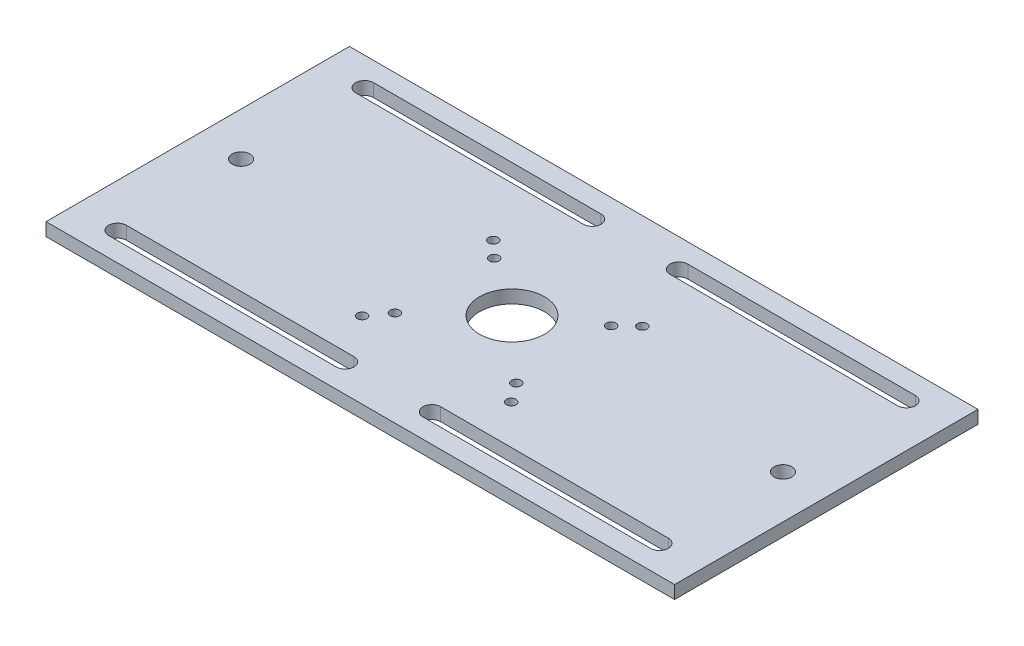
ISO-10303-21;
HEADER;
FILE_DESCRIPTION(('STEP AP214'),'2;1');
FILE_NAME('part.step','',(''),(''),'','','');
FILE_SCHEMA(('AUTOMOTIVE_DESIGN { 1 0 10303 214 1 1 1 1 }'));
ENDSEC;
DATA;
#1=APPLICATION_CONTEXT('core data for automotive mechanical design processes');
#2=APPLICATION_PROTOCOL_DEFINITION('international standard','automotive_design',2000,#1);
#3=PRODUCT_CONTEXT('',#1,'mechanical');
#4=PRODUCT('Part','Part','',(#3));
#5=PRODUCT_RELATED_PRODUCT_CATEGORY('part','',(#4));
#6=PRODUCT_DEFINITION_FORMATION('','',#4);
#7=PRODUCT_DEFINITION_CONTEXT('part definition',#1,'design');
#8=PRODUCT_DEFINITION('design','',#6,#7);
#9=PRODUCT_DEFINITION_SHAPE('','',#8);
#10=(LENGTH_UNIT() NAMED_UNIT(*) SI_UNIT(.MILLI.,.METRE.));
#11=(NAMED_UNIT(*) PLANE_ANGLE_UNIT() SI_UNIT($,.RADIAN.));
#12=(NAMED_UNIT(*) SI_UNIT($,.STERADIAN.) SOLID_ANGLE_UNIT());
#13=UNCERTAINTY_MEASURE_WITH_UNIT(LENGTH_MEASURE(1.E-05),#10,'distance_accuracy_value','');
#14=(GEOMETRIC_REPRESENTATION_CONTEXT(3) GLOBAL_UNCERTAINTY_ASSIGNED_CONTEXT((#13)) GLOBAL_UNIT_ASSIGNED_CONTEXT((#10,
#11,#12)) REPRESENTATION_CONTEXT('',''));
#15=CARTESIAN_POINT('',(0.,0.,0.));
#16=DIRECTION('',(0.,0.,1.));
#17=DIRECTION('',(1.,0.,0.));
#18=AXIS2_PLACEMENT_3D('',#15,#16,#17);
#19=CARTESIAN_POINT('',(0.,6.,0.));
#20=DIRECTION('',(0.,1.,0.));
#21=DIRECTION('',(0.,0.,1.));
#22=AXIS2_PLACEMENT_3D('',#19,#20,#21);
#23=PLANE('',#22);
#24=CARTESIAN_POINT('',(27.,6.,-18.75));
#25=DIRECTION('',(0.,1.,0.));
#26=DIRECTION('',(0.,0.,1.));
#27=AXIS2_PLACEMENT_3D('',#24,#25,#26);
#28=CIRCLE('',#27,2.2);
#29=CARTESIAN_POINT('',(27.,6.,-16.55));
#30=VERTEX_POINT('',#29);
#31=EDGE_CURVE('E503',#30,#30,#28,.T.);
#32=ORIENTED_EDGE('',*,*,#31,.F.);
#33=EDGE_LOOP('',(#32));
#34=FACE_BOUND('',#33,.T.);
#35=CARTESIAN_POINT('',(-27.,6.,-18.75));
#36=DIRECTION('',(0.,1.,0.));
#37=DIRECTION('',(0.,0.,1.));
#38=AXIS2_PLACEMENT_3D('',#35,#36,#37);
#39=CIRCLE('',#38,2.2);
#40=CARTESIAN_POINT('',(-27.,6.,-16.55));
#41=VERTEX_POINT('',#40);
#42=EDGE_CURVE('E515',#41,#41,#39,.T.);
#43=ORIENTED_EDGE('',*,*,#42,.F.);
#44=EDGE_LOOP('',(#43));
#45=FACE_BOUND('',#44,.T.);
#46=CARTESIAN_POINT('',(-28.,6.,26.));
#47=DIRECTION('',(0.,1.,0.));
#48=DIRECTION('',(0.,0.,1.));
#49=AXIS2_PLACEMENT_3D('',#46,#47,#48);
#50=CIRCLE('',#49,2.2);
#51=CARTESIAN_POINT('',(-28.,6.,28.2));
#52=VERTEX_POINT('',#51);
#53=EDGE_CURVE('E527',#52,#52,#50,.T.);
#54=ORIENTED_EDGE('',*,*,#53,.F.);
#55=EDGE_LOOP('',(#54));
#56=FACE_BOUND('',#55,.T.);
#57=CARTESIAN_POINT('',(-34.4,6.,-25.75));
#58=DIRECTION('',(0.,1.,0.));
#59=DIRECTION('',(0.,0.,1.));
#60=AXIS2_PLACEMENT_3D('',#57,#58,#59);
#61=CIRCLE('',#60,2.2);
#62=CARTESIAN_POINT('',(-34.4,6.,-23.55));
#63=VERTEX_POINT('',#62);
#64=EDGE_CURVE('E539',#63,#63,#61,.T.);
#65=ORIENTED_EDGE('',*,*,#64,.F.);
#66=EDGE_LOOP('',(#65));
#67=FACE_BOUND('',#66,.T.);
#68=CARTESIAN_POINT('',(125.,6.,0.));
#69=DIRECTION('',(0.,1.,0.));
#70=DIRECTION('',(0.,0.,-1.));
#71=AXIS2_PLACEMENT_3D('',#68,#69,#70);
#72=CIRCLE('',#71,4.09999999999999);
#73=CARTESIAN_POINT('',(125.,6.,-4.09999999999999));
#74=VERTEX_POINT('',#73);
#75=EDGE_CURVE('E551',#74,#74,#72,.T.);
#76=ORIENTED_EDGE('',*,*,#75,.F.);
#77=EDGE_LOOP('',(#76));
#78=FACE_BOUND('',#77,.T.);
#79=DIRECTION('',(1.,0.,0.));
#80=VECTOR('',#79,1.);
#81=CARTESIAN_POINT('',(125.,6.,-52.9));
#82=LINE('',#81,#80);
#83=CARTESIAN_POINT('',(20.,6.,-52.9));
#84=VERTEX_POINT('',#83);
#85=CARTESIAN_POINT('',(125.,6.,-52.9));
#86=VERTEX_POINT('',#85);
#87=EDGE_CURVE('E182',#84,#86,#82,.T.);
#88=ORIENTED_EDGE('',*,*,#87,.F.);
#89=CARTESIAN_POINT('',(20.,6.,-57.));
#90=DIRECTION('',(0.,1.,0.));
#91=DIRECTION('',(0.,0.,1.));
#92=AXIS2_PLACEMENT_3D('',#89,#90,#91);
#93=CIRCLE('',#92,4.10000000000003);
#94=CARTESIAN_POINT('',(20.,6.,-61.1));
#95=VERTEX_POINT('',#94);
#96=EDGE_CURVE('E174',#95,#84,#93,.T.);
#97=ORIENTED_EDGE('',*,*,#96,.F.);
#98=DIRECTION('',(-1.,0.,0.));
#99=VECTOR('',#98,1.);
#100=CARTESIAN_POINT('',(125.,6.,-61.1));
#101=LINE('',#100,#99);
#102=CARTESIAN_POINT('',(125.,6.,-61.1));
#103=VERTEX_POINT('',#102);
#104=EDGE_CURVE('E197',#103,#95,#101,.T.);
#105=ORIENTED_EDGE('',*,*,#104,.F.);
#106=CARTESIAN_POINT('',(125.,6.,-57.));
#107=DIRECTION('',(0.,1.,0.));
#108=DIRECTION('',(0.,0.,-1.));
#109=AXIS2_PLACEMENT_3D('',#106,#107,#108);
#110=CIRCLE('',#109,4.10000000000003);
#111=EDGE_CURVE('E195',#86,#103,#110,.T.);
#112=ORIENTED_EDGE('',*,*,#111,.F.);
#113=EDGE_LOOP('',(#88,#97,#105,#112));
#114=FACE_BOUND('',#113,.T.);
#115=DIRECTION('',(-1.,0.,0.));
#116=VECTOR('',#115,1.);
#117=CARTESIAN_POINT('',(125.,6.,52.8999999999999));
#118=LINE('',#117,#116);
#119=CARTESIAN_POINT('',(125.,6.,52.8999999999999));
#120=VERTEX_POINT('',#119);
#121=CARTESIAN_POINT('',(20.0000000000001,6.,52.9));
#122=VERTEX_POINT('',#121);
#123=EDGE_CURVE('E215',#120,#122,#118,.T.);
#124=ORIENTED_EDGE('',*,*,#123,.F.);
#125=CARTESIAN_POINT('',(125.,6.,57.));
#126=DIRECTION('',(0.,1.,0.));
#127=DIRECTION('',(0.,0.,1.));
#128=AXIS2_PLACEMENT_3D('',#125,#126,#127);
#129=CIRCLE('',#128,4.10000000000003);
#130=CARTESIAN_POINT('',(125.,6.,61.1));
#131=VERTEX_POINT('',#130);
#132=EDGE_CURVE('E213',#131,#120,#129,.T.);
#133=ORIENTED_EDGE('',*,*,#132,.F.);
#134=DIRECTION('',(1.,0.,0.));
#135=VECTOR('',#134,1.);
#136=CARTESIAN_POINT('',(125.,6.,61.1));
#137=LINE('',#136,#135);
#138=CARTESIAN_POINT('',(20.0000000000001,6.,61.1));
#139=VERTEX_POINT('',#138);
#140=EDGE_CURVE('E221',#139,#131,#137,.T.);
#141=ORIENTED_EDGE('',*,*,#140,.F.);
#142=CARTESIAN_POINT('',(20.0000000000001,6.,57.));
#143=DIRECTION('',(0.,1.,0.));
#144=DIRECTION('',(0.,0.,-1.));
#145=AXIS2_PLACEMENT_3D('',#142,#143,#144);
#146=CIRCLE('',#145,4.10000000000003);
#147=EDGE_CURVE('E218',#122,#139,#146,.T.);
#148=ORIENTED_EDGE('',*,*,#147,.F.);
#149=EDGE_LOOP('',(#124,#133,#141,#148));
#150=FACE_BOUND('',#149,.T.);
#151=DIRECTION('',(-1.,0.,0.));
#152=VECTOR('',#151,1.);
#153=CARTESIAN_POINT('',(-125.,6.,52.9));
#154=LINE('',#153,#152);
#155=CARTESIAN_POINT('',(-20.,6.,52.9));
#156=VERTEX_POINT('',#155);
#157=CARTESIAN_POINT('',(-125.,6.,52.9));
#158=VERTEX_POINT('',#157);
#159=EDGE_CURVE('E246',#156,#158,#154,.T.);
#160=ORIENTED_EDGE('',*,*,#159,.F.);
#161=CARTESIAN_POINT('',(-20.,6.,57.));
#162=DIRECTION('',(0.,1.,0.));
#163=DIRECTION('',(0.,0.,1.));
#164=AXIS2_PLACEMENT_3D('',#161,#162,#163);
#165=CIRCLE('',#164,4.10000000000003);
#166=CARTESIAN_POINT('',(-20.,6.,61.1));
#167=VERTEX_POINT('',#166);
#168=EDGE_CURVE('E244',#167,#156,#165,.T.);
#169=ORIENTED_EDGE('',*,*,#168,.F.);
#170=DIRECTION('',(1.,0.,0.));
#171=VECTOR('',#170,1.);
#172=CARTESIAN_POINT('',(-125.,6.,61.1));
#173=LINE('',#172,#171);
#174=CARTESIAN_POINT('',(-125.,6.,61.1));
#175=VERTEX_POINT('',#174);
#176=EDGE_CURVE('E252',#175,#167,#173,.T.);
#177=ORIENTED_EDGE('',*,*,#176,.F.);
#178=CARTESIAN_POINT('',(-125.,6.,57.));
#179=DIRECTION('',(0.,1.,0.));
#180=DIRECTION('',(0.,0.,-1.));
#181=AXIS2_PLACEMENT_3D('',#178,#179,#180);
#182=CIRCLE('',#181,4.10000000000003);
#183=EDGE_CURVE('E249',#158,#175,#182,.T.);
#184=ORIENTED_EDGE('',*,*,#183,.F.);
#185=EDGE_LOOP('',(#160,#169,#177,#184));
#186=FACE_BOUND('',#185,.T.);
#187=DIRECTION('',(1.,0.,0.));
#188=VECTOR('',#187,1.);
#189=CARTESIAN_POINT('',(-125.,6.,-52.9));
#190=LINE('',#189,#188);
#191=CARTESIAN_POINT('',(-125.,6.,-52.9));
#192=VERTEX_POINT('',#191);
#193=CARTESIAN_POINT('',(-20.,6.,-52.9));
#194=VERTEX_POINT('',#193);
#195=EDGE_CURVE('E277',#192,#194,#190,.T.);
#196=ORIENTED_EDGE('',*,*,#195,.F.);
#197=CARTESIAN_POINT('',(-125.,6.,-57.));
#198=DIRECTION('',(0.,1.,0.));
#199=DIRECTION('',(0.,0.,1.));
#200=AXIS2_PLACEMENT_3D('',#197,#198,#199);
#201=CIRCLE('',#200,4.10000000000003);
#202=CARTESIAN_POINT('',(-125.,6.,-61.1));
#203=VERTEX_POINT('',#202);
#204=EDGE_CURVE('E275',#203,#192,#201,.T.);
#205=ORIENTED_EDGE('',*,*,#204,.F.);
#206=DIRECTION('',(-1.,0.,0.));
#207=VECTOR('',#206,1.);
#208=CARTESIAN_POINT('',(-125.,6.,-61.1));
#209=LINE('',#208,#207);
#210=CARTESIAN_POINT('',(-20.,6.,-61.1));
#211=VERTEX_POINT('',#210);
#212=EDGE_CURVE('E283',#211,#203,#209,.T.);
#213=ORIENTED_EDGE('',*,*,#212,.F.);
#214=CARTESIAN_POINT('',(-20.,6.,-57.));
#215=DIRECTION('',(0.,1.,0.));
#216=DIRECTION('',(0.,0.,-1.));
#217=AXIS2_PLACEMENT_3D('',#214,#215,#216);
#218=CIRCLE('',#217,4.10000000000003);
#219=EDGE_CURVE('E280',#194,#211,#218,.T.);
#220=ORIENTED_EDGE('',*,*,#219,.F.);
#221=EDGE_LOOP('',(#196,#205,#213,#220));
#222=FACE_BOUND('',#221,.T.);
#223=DIRECTION('',(0.,0.,-1.));
#224=VECTOR('',#223,1.);
#225=CARTESIAN_POINT('',(145.,6.,-70.));
#226=LINE('',#225,#224);
#227=CARTESIAN_POINT('',(145.,6.,70.));
#228=VERTEX_POINT('',#227);
#229=CARTESIAN_POINT('',(145.,6.,-70.));
#230=VERTEX_POINT('',#229);
#231=EDGE_CURVE('E306',#228,#230,#226,.T.);
#232=ORIENTED_EDGE('',*,*,#231,.T.);
#233=DIRECTION('',(-1.,0.,0.));
#234=VECTOR('',#233,1.);
#235=CARTESIAN_POINT('',(-145.,6.,-70.));
#236=LINE('',#235,#234);
#237=CARTESIAN_POINT('',(-145.,6.,-70.));
#238=VERTEX_POINT('',#237);
#239=EDGE_CURVE('E309',#230,#238,#236,.T.);
#240=ORIENTED_EDGE('',*,*,#239,.T.);
#241=DIRECTION('',(0.,0.,1.));
#242=VECTOR('',#241,1.);
#243=CARTESIAN_POINT('',(-145.,6.,-70.));
#244=LINE('',#243,#242);
#245=CARTESIAN_POINT('',(-145.,6.,70.));
#246=VERTEX_POINT('',#245);
#247=EDGE_CURVE('E312',#238,#246,#244,.T.);
#248=ORIENTED_EDGE('',*,*,#247,.T.);
#249=DIRECTION('',(1.,0.,0.));
#250=VECTOR('',#249,1.);
#251=CARTESIAN_POINT('',(-145.,6.,70.));
#252=LINE('',#251,#250);
#253=EDGE_CURVE('E314',#246,#228,#252,.T.);
#254=ORIENTED_EDGE('',*,*,#253,.T.);
#255=EDGE_LOOP('',(#232,#240,#248,#254));
#256=FACE_BOUND('',#255,.T.);
#257=CARTESIAN_POINT('',(-125.,6.,0.));
#258=DIRECTION('',(0.,1.,0.));
#259=DIRECTION('',(0.,0.,1.));
#260=AXIS2_PLACEMENT_3D('',#257,#258,#259);
#261=CIRCLE('',#260,4.09999999999999);
#262=CARTESIAN_POINT('',(-125.,6.,4.09999999999999));
#263=VERTEX_POINT('',#262);
#264=EDGE_CURVE('E203',#263,#263,#261,.T.);
#265=ORIENTED_EDGE('',*,*,#264,.F.);
#266=EDGE_LOOP('',(#265));
#267=FACE_BOUND('',#266,.T.);
#268=CARTESIAN_POINT('',(0.,6.,0.));
#269=DIRECTION('',(0.,1.,0.));
#270=DIRECTION('',(0.,0.,1.));
#271=AXIS2_PLACEMENT_3D('',#268,#269,#270);
#272=CIRCLE('',#271,15.);
#273=CARTESIAN_POINT('',(0.,6.,15.));
#274=VERTEX_POINT('',#273);
#275=EDGE_CURVE('E545',#274,#274,#272,.T.);
#276=ORIENTED_EDGE('',*,*,#275,.F.);
#277=EDGE_LOOP('',(#276));
#278=FACE_BOUND('',#277,.T.);
#279=CARTESIAN_POINT('',(34.4,6.,-25.75));
#280=DIRECTION('',(0.,1.,0.));
#281=DIRECTION('',(0.,0.,1.));
#282=AXIS2_PLACEMENT_3D('',#279,#280,#281);
#283=CIRCLE('',#282,2.2);
#284=CARTESIAN_POINT('',(34.4,6.,-23.55));
#285=VERTEX_POINT('',#284);
#286=EDGE_CURVE('E533',#285,#285,#283,.T.);
#287=ORIENTED_EDGE('',*,*,#286,.F.);
#288=EDGE_LOOP('',(#287));
#289=FACE_BOUND('',#288,.T.);
#290=CARTESIAN_POINT('',(-34.4,6.,34.75));
#291=DIRECTION('',(0.,1.,0.));
#292=DIRECTION('',(0.,0.,1.));
#293=AXIS2_PLACEMENT_3D('',#290,#291,#292);
#294=CIRCLE('',#293,2.2);
#295=CARTESIAN_POINT('',(-34.4,6.,36.95));
#296=VERTEX_POINT('',#295);
#297=EDGE_CURVE('E521',#296,#296,#294,.T.);
#298=ORIENTED_EDGE('',*,*,#297,.F.);
#299=EDGE_LOOP('',(#298));
#300=FACE_BOUND('',#299,.T.);
#301=CARTESIAN_POINT('',(28.,6.,26.));
#302=DIRECTION('',(0.,1.,0.));
#303=DIRECTION('',(0.,0.,1.));
#304=AXIS2_PLACEMENT_3D('',#301,#302,#303);
#305=CIRCLE('',#304,2.2);
#306=CARTESIAN_POINT('',(28.,6.,28.2));
#307=VERTEX_POINT('',#306);
#308=EDGE_CURVE('E509',#307,#307,#305,.T.);
#309=ORIENTED_EDGE('',*,*,#308,.F.);
#310=EDGE_LOOP('',(#309));
#311=FACE_BOUND('',#310,.T.);
#312=CARTESIAN_POINT('',(34.4,6.,34.75));
#313=DIRECTION('',(0.,1.,0.));
#314=DIRECTION('',(0.,0.,1.));
#315=AXIS2_PLACEMENT_3D('',#312,#313,#314);
#316=CIRCLE('',#315,2.2);
#317=CARTESIAN_POINT('',(34.4,6.,36.95));
#318=VERTEX_POINT('',#317);
#319=EDGE_CURVE('E494',#318,#318,#316,.T.);
#320=ORIENTED_EDGE('',*,*,#319,.F.);
#321=EDGE_LOOP('',(#320));
#322=FACE_BOUND('',#321,.T.);
#323=ADVANCED_FACE('F37',(#34,#45,#56,#67,#78,#114,#150,#186,#222,#256,#267,#278,#289,#300,#311,
#322),#23,.T.);
#324=CARTESIAN_POINT('',(0.,0.,0.));
#325=DIRECTION('',(0.,1.,0.));
#326=DIRECTION('',(0.,0.,1.));
#327=AXIS2_PLACEMENT_3D('',#324,#325,#326);
#328=PLANE('',#327);
#329=CARTESIAN_POINT('',(125.,0.,57.));
#330=DIRECTION('',(0.,1.,0.));
#331=DIRECTION('',(0.,0.,1.));
#332=AXIS2_PLACEMENT_3D('',#329,#330,#331);
#333=CIRCLE('',#332,4.10000000000003);
#334=CARTESIAN_POINT('',(125.,0.,61.1));
#335=VERTEX_POINT('',#334);
#336=CARTESIAN_POINT('',(125.,0.,52.8999999999999));
#337=VERTEX_POINT('',#336);
#338=EDGE_CURVE('E190',#335,#337,#333,.T.);
#339=ORIENTED_EDGE('',*,*,#338,.T.);
#340=DIRECTION('',(-1.,0.,0.));
#341=VECTOR('',#340,1.);
#342=CARTESIAN_POINT('',(125.,0.,52.8999999999999));
#343=LINE('',#342,#341);
#344=CARTESIAN_POINT('',(20.0000000000001,0.,52.9));
#345=VERTEX_POINT('',#344);
#346=EDGE_CURVE('E226',#337,#345,#343,.T.);
#347=ORIENTED_EDGE('',*,*,#346,.T.);
#348=CARTESIAN_POINT('',(20.0000000000001,0.,57.));
#349=DIRECTION('',(0.,1.,0.));
#350=DIRECTION('',(0.,0.,-1.));
#351=AXIS2_PLACEMENT_3D('',#348,#349,#350);
#352=CIRCLE('',#351,4.10000000000003);
#353=CARTESIAN_POINT('',(20.0000000000001,0.,61.1));
#354=VERTEX_POINT('',#353);
#355=EDGE_CURVE('E229',#345,#354,#352,.T.);
#356=ORIENTED_EDGE('',*,*,#355,.T.);
#357=DIRECTION('',(1.,0.,0.));
#358=VECTOR('',#357,1.);
#359=CARTESIAN_POINT('',(125.,0.,61.1));
#360=LINE('',#359,#358);
#361=EDGE_CURVE('E216',#354,#335,#360,.T.);
#362=ORIENTED_EDGE('',*,*,#361,.T.);
#363=EDGE_LOOP('',(#339,#347,#356,#362));
#364=FACE_BOUND('',#363,.T.);
#365=CARTESIAN_POINT('',(-125.,0.,-57.));
#366=DIRECTION('',(0.,1.,0.));
#367=DIRECTION('',(0.,0.,1.));
#368=AXIS2_PLACEMENT_3D('',#365,#366,#367);
#369=CIRCLE('',#368,4.10000000000003);
#370=CARTESIAN_POINT('',(-125.,0.,-61.1));
#371=VERTEX_POINT('',#370);
#372=CARTESIAN_POINT('',(-125.,0.,-52.9));
#373=VERTEX_POINT('',#372);
#374=EDGE_CURVE('E274',#371,#373,#369,.T.);
#375=ORIENTED_EDGE('',*,*,#374,.T.);
#376=DIRECTION('',(1.,0.,0.));
#377=VECTOR('',#376,1.);
#378=CARTESIAN_POINT('',(-125.,0.,-52.9));
#379=LINE('',#378,#377);
#380=CARTESIAN_POINT('',(-20.,0.,-52.9));
#381=VERTEX_POINT('',#380);
#382=EDGE_CURVE('E288',#373,#381,#379,.T.);
#383=ORIENTED_EDGE('',*,*,#382,.T.);
#384=CARTESIAN_POINT('',(-20.,0.,-57.));
#385=DIRECTION('',(0.,1.,0.));
#386=DIRECTION('',(0.,0.,-1.));
#387=AXIS2_PLACEMENT_3D('',#384,#385,#386);
#388=CIRCLE('',#387,4.10000000000003);
#389=CARTESIAN_POINT('',(-20.,0.,-61.1));
#390=VERTEX_POINT('',#389);
#391=EDGE_CURVE('E291',#381,#390,#388,.T.);
#392=ORIENTED_EDGE('',*,*,#391,.T.);
#393=DIRECTION('',(-1.,0.,0.));
#394=VECTOR('',#393,1.);
#395=CARTESIAN_POINT('',(-125.,0.,-61.1));
#396=LINE('',#395,#394);
#397=EDGE_CURVE('E278',#390,#371,#396,.T.);
#398=ORIENTED_EDGE('',*,*,#397,.T.);
#399=EDGE_LOOP('',(#375,#383,#392,#398));
#400=FACE_BOUND('',#399,.T.);
#401=DIRECTION('',(0.,0.,-1.));
#402=VECTOR('',#401,1.);
#403=CARTESIAN_POINT('',(145.,0.,-70.));
#404=LINE('',#403,#402);
#405=CARTESIAN_POINT('',(145.,0.,70.));
#406=VERTEX_POINT('',#405);
#407=CARTESIAN_POINT('',(145.,0.,-70.));
#408=VERTEX_POINT('',#407);
#409=EDGE_CURVE('E305',#406,#408,#404,.T.);
#410=ORIENTED_EDGE('',*,*,#409,.F.);
#411=DIRECTION('',(1.,0.,0.));
#412=VECTOR('',#411,1.);
#413=CARTESIAN_POINT('',(-145.,0.,70.));
#414=LINE('',#413,#412);
#415=CARTESIAN_POINT('',(-145.,0.,70.));
#416=VERTEX_POINT('',#415);
#417=EDGE_CURVE('E310',#416,#406,#414,.T.);
#418=ORIENTED_EDGE('',*,*,#417,.F.);
#419=DIRECTION('',(0.,0.,1.));
#420=VECTOR('',#419,1.);
#421=CARTESIAN_POINT('',(-145.,0.,-70.));
#422=LINE('',#421,#420);
#423=CARTESIAN_POINT('',(-145.,0.,-70.));
#424=VERTEX_POINT('',#423);
#425=EDGE_CURVE('E321',#424,#416,#422,.T.);
#426=ORIENTED_EDGE('',*,*,#425,.F.);
#427=DIRECTION('',(-1.,0.,0.));
#428=VECTOR('',#427,1.);
#429=CARTESIAN_POINT('',(-145.,0.,-70.));
#430=LINE('',#429,#428);
#431=EDGE_CURVE('E319',#408,#424,#430,.T.);
#432=ORIENTED_EDGE('',*,*,#431,.F.);
#433=EDGE_LOOP('',(#410,#418,#426,#432));
#434=FACE_BOUND('',#433,.T.);
#435=CARTESIAN_POINT('',(-20.,0.,57.));
#436=DIRECTION('',(0.,1.,0.));
#437=DIRECTION('',(0.,0.,1.));
#438=AXIS2_PLACEMENT_3D('',#435,#436,#437);
#439=CIRCLE('',#438,4.10000000000003);
#440=CARTESIAN_POINT('',(-20.,0.,61.1));
#441=VERTEX_POINT('',#440);
#442=CARTESIAN_POINT('',(-20.,0.,52.9));
#443=VERTEX_POINT('',#442);
#444=EDGE_CURVE('E243',#441,#443,#439,.T.);
#445=ORIENTED_EDGE('',*,*,#444,.T.);
#446=DIRECTION('',(-1.,0.,0.));
#447=VECTOR('',#446,1.);
#448=CARTESIAN_POINT('',(-125.,0.,52.9));
#449=LINE('',#448,#447);
#450=CARTESIAN_POINT('',(-125.,0.,52.9));
#451=VERTEX_POINT('',#450);
#452=EDGE_CURVE('E257',#443,#451,#449,.T.);
#453=ORIENTED_EDGE('',*,*,#452,.T.);
#454=CARTESIAN_POINT('',(-125.,0.,57.));
#455=DIRECTION('',(0.,1.,0.));
#456=DIRECTION('',(0.,0.,-1.));
#457=AXIS2_PLACEMENT_3D('',#454,#455,#456);
#458=CIRCLE('',#457,4.10000000000003);
#459=CARTESIAN_POINT('',(-125.,0.,61.1));
#460=VERTEX_POINT('',#459);
#461=EDGE_CURVE('E260',#451,#460,#458,.T.);
#462=ORIENTED_EDGE('',*,*,#461,.T.);
#463=DIRECTION('',(1.,0.,0.));
#464=VECTOR('',#463,1.);
#465=CARTESIAN_POINT('',(-125.,0.,61.1));
#466=LINE('',#465,#464);
#467=EDGE_CURVE('E247',#460,#441,#466,.T.);
#468=ORIENTED_EDGE('',*,*,#467,.T.);
#469=EDGE_LOOP('',(#445,#453,#462,#468));
#470=FACE_BOUND('',#469,.T.);
#471=CARTESIAN_POINT('',(20.,0.,-57.));
#472=DIRECTION('',(0.,1.,0.));
#473=DIRECTION('',(0.,0.,1.));
#474=AXIS2_PLACEMENT_3D('',#471,#472,#473);
#475=CIRCLE('',#474,4.10000000000003);
#476=CARTESIAN_POINT('',(20.,0.,-61.1));
#477=VERTEX_POINT('',#476);
#478=CARTESIAN_POINT('',(20.,0.,-52.9));
#479=VERTEX_POINT('',#478);
#480=EDGE_CURVE('E60',#477,#479,#475,.T.);
#481=ORIENTED_EDGE('',*,*,#480,.T.);
#482=DIRECTION('',(1.,0.,0.));
#483=VECTOR('',#482,1.);
#484=CARTESIAN_POINT('',(125.,0.,-52.9));
#485=LINE('',#484,#483);
#486=CARTESIAN_POINT('',(125.,0.,-52.9));
#487=VERTEX_POINT('',#486);
#488=EDGE_CURVE('E189',#479,#487,#485,.T.);
#489=ORIENTED_EDGE('',*,*,#488,.T.);
#490=CARTESIAN_POINT('',(125.,0.,-57.));
#491=DIRECTION('',(0.,1.,0.));
#492=DIRECTION('',(0.,0.,-1.));
#493=AXIS2_PLACEMENT_3D('',#490,#491,#492);
#494=CIRCLE('',#493,4.10000000000003);
#495=CARTESIAN_POINT('',(125.,0.,-61.1));
#496=VERTEX_POINT('',#495);
#497=EDGE_CURVE('E205',#487,#496,#494,.T.);
#498=ORIENTED_EDGE('',*,*,#497,.T.);
#499=DIRECTION('',(-1.,0.,0.));
#500=VECTOR('',#499,1.);
#501=CARTESIAN_POINT('',(125.,0.,-61.1));
#502=LINE('',#501,#500);
#503=EDGE_CURVE('E183',#496,#477,#502,.T.);
#504=ORIENTED_EDGE('',*,*,#503,.T.);
#505=EDGE_LOOP('',(#481,#489,#498,#504));
#506=FACE_BOUND('',#505,.T.);
#507=CARTESIAN_POINT('',(-125.,0.,0.));
#508=DIRECTION('',(0.,1.,0.));
#509=DIRECTION('',(0.,0.,1.));
#510=AXIS2_PLACEMENT_3D('',#507,#508,#509);
#511=CIRCLE('',#510,4.09999999999999);
#512=CARTESIAN_POINT('',(-125.,0.,4.09999999999999));
#513=VERTEX_POINT('',#512);
#514=EDGE_CURVE('E554',#513,#513,#511,.T.);
#515=ORIENTED_EDGE('',*,*,#514,.T.);
#516=EDGE_LOOP('',(#515));
#517=FACE_BOUND('',#516,.T.);
#518=CARTESIAN_POINT('',(125.,0.,0.));
#519=DIRECTION('',(0.,1.,0.));
#520=DIRECTION('',(0.,0.,-1.));
#521=AXIS2_PLACEMENT_3D('',#518,#519,#520);
#522=CIRCLE('',#521,4.09999999999999);
#523=CARTESIAN_POINT('',(125.,0.,-4.09999999999999));
#524=VERTEX_POINT('',#523);
#525=EDGE_CURVE('E548',#524,#524,#522,.T.);
#526=ORIENTED_EDGE('',*,*,#525,.T.);
#527=EDGE_LOOP('',(#526));
#528=FACE_BOUND('',#527,.T.);
#529=CARTESIAN_POINT('',(0.,0.,0.));
#530=DIRECTION('',(0.,1.,0.));
#531=DIRECTION('',(0.,0.,1.));
#532=AXIS2_PLACEMENT_3D('',#529,#530,#531);
#533=CIRCLE('',#532,15.);
#534=CARTESIAN_POINT('',(0.,0.,15.));
#535=VERTEX_POINT('',#534);
#536=EDGE_CURVE('E542',#535,#535,#533,.T.);
#537=ORIENTED_EDGE('',*,*,#536,.T.);
#538=EDGE_LOOP('',(#537));
#539=FACE_BOUND('',#538,.T.);
#540=CARTESIAN_POINT('',(-34.4,0.,-25.75));
#541=DIRECTION('',(0.,1.,0.));
#542=DIRECTION('',(0.,0.,1.));
#543=AXIS2_PLACEMENT_3D('',#540,#541,#542);
#544=CIRCLE('',#543,2.2);
#545=CARTESIAN_POINT('',(-34.4,0.,-23.55));
#546=VERTEX_POINT('',#545);
#547=EDGE_CURVE('E536',#546,#546,#544,.T.);
#548=ORIENTED_EDGE('',*,*,#547,.T.);
#549=EDGE_LOOP('',(#548));
#550=FACE_BOUND('',#549,.T.);
#551=CARTESIAN_POINT('',(34.4,0.,-25.75));
#552=DIRECTION('',(0.,1.,0.));
#553=DIRECTION('',(0.,0.,1.));
#554=AXIS2_PLACEMENT_3D('',#551,#552,#553);
#555=CIRCLE('',#554,2.2);
#556=CARTESIAN_POINT('',(34.4,0.,-23.55));
#557=VERTEX_POINT('',#556);
#558=EDGE_CURVE('E530',#557,#557,#555,.T.);
#559=ORIENTED_EDGE('',*,*,#558,.T.);
#560=EDGE_LOOP('',(#559));
#561=FACE_BOUND('',#560,.T.);
#562=CARTESIAN_POINT('',(-28.,0.,26.));
#563=DIRECTION('',(0.,1.,0.));
#564=DIRECTION('',(0.,0.,1.));
#565=AXIS2_PLACEMENT_3D('',#562,#563,#564);
#566=CIRCLE('',#565,2.2);
#567=CARTESIAN_POINT('',(-28.,0.,28.2));
#568=VERTEX_POINT('',#567);
#569=EDGE_CURVE('E524',#568,#568,#566,.T.);
#570=ORIENTED_EDGE('',*,*,#569,.T.);
#571=EDGE_LOOP('',(#570));
#572=FACE_BOUND('',#571,.T.);
#573=CARTESIAN_POINT('',(-34.4,0.,34.75));
#574=DIRECTION('',(0.,1.,0.));
#575=DIRECTION('',(0.,0.,1.));
#576=AXIS2_PLACEMENT_3D('',#573,#574,#575);
#577=CIRCLE('',#576,2.2);
#578=CARTESIAN_POINT('',(-34.4,0.,36.95));
#579=VERTEX_POINT('',#578);
#580=EDGE_CURVE('E518',#579,#579,#577,.T.);
#581=ORIENTED_EDGE('',*,*,#580,.T.);
#582=EDGE_LOOP('',(#581));
#583=FACE_BOUND('',#582,.T.);
#584=CARTESIAN_POINT('',(-27.,0.,-18.75));
#585=DIRECTION('',(0.,1.,0.));
#586=DIRECTION('',(0.,0.,1.));
#587=AXIS2_PLACEMENT_3D('',#584,#585,#586);
#588=CIRCLE('',#587,2.2);
#589=CARTESIAN_POINT('',(-27.,0.,-16.55));
#590=VERTEX_POINT('',#589);
#591=EDGE_CURVE('E512',#590,#590,#588,.T.);
#592=ORIENTED_EDGE('',*,*,#591,.T.);
#593=EDGE_LOOP('',(#592));
#594=FACE_BOUND('',#593,.T.);
#595=CARTESIAN_POINT('',(28.,0.,26.));
#596=DIRECTION('',(0.,1.,0.));
#597=DIRECTION('',(0.,0.,1.));
#598=AXIS2_PLACEMENT_3D('',#595,#596,#597);
#599=CIRCLE('',#598,2.2);
#600=CARTESIAN_POINT('',(28.,0.,28.2));
#601=VERTEX_POINT('',#600);
#602=EDGE_CURVE('E506',#601,#601,#599,.T.);
#603=ORIENTED_EDGE('',*,*,#602,.T.);
#604=EDGE_LOOP('',(#603));
#605=FACE_BOUND('',#604,.T.);
#606=CARTESIAN_POINT('',(27.,0.,-18.75));
#607=DIRECTION('',(0.,1.,0.));
#608=DIRECTION('',(0.,0.,1.));
#609=AXIS2_PLACEMENT_3D('',#606,#607,#608);
#610=CIRCLE('',#609,2.2);
#611=CARTESIAN_POINT('',(27.,0.,-16.55));
#612=VERTEX_POINT('',#611);
#613=EDGE_CURVE('E500',#612,#612,#610,.T.);
#614=ORIENTED_EDGE('',*,*,#613,.T.);
#615=EDGE_LOOP('',(#614));
#616=FACE_BOUND('',#615,.T.);
#617=CARTESIAN_POINT('',(34.4,0.,34.75));
#618=DIRECTION('',(0.,1.,0.));
#619=DIRECTION('',(0.,0.,1.));
#620=AXIS2_PLACEMENT_3D('',#617,#618,#619);
#621=CIRCLE('',#620,2.2);
#622=CARTESIAN_POINT('',(34.4,0.,36.95));
#623=VERTEX_POINT('',#622);
#624=EDGE_CURVE('E497',#623,#623,#621,.T.);
#625=ORIENTED_EDGE('',*,*,#624,.T.);
#626=EDGE_LOOP('',(#625));
#627=FACE_BOUND('',#626,.T.);
#628=ADVANCED_FACE('F339',(#364,#400,#434,#470,#506,#517,#528,#539,#550,#561,#572,#583,#594,
#605,#616,#627),#328,.F.);
#629=CARTESIAN_POINT('',(145.,6.,-70.));
#630=DIRECTION('',(-1.,0.,0.));
#631=DIRECTION('',(0.,0.,1.));
#632=AXIS2_PLACEMENT_3D('',#629,#630,#631);
#633=PLANE('',#632);
#634=ORIENTED_EDGE('',*,*,#409,.T.);
#635=DIRECTION('',(0.,-1.,0.));
#636=VECTOR('',#635,1.);
#637=CARTESIAN_POINT('',(145.,6.,-70.));
#638=LINE('',#637,#636);
#639=EDGE_CURVE('E11',#230,#408,#638,.T.);
#640=ORIENTED_EDGE('',*,*,#639,.F.);
#641=ORIENTED_EDGE('',*,*,#231,.F.);
#642=DIRECTION('',(0.,-1.,0.));
#643=VECTOR('',#642,1.);
#644=CARTESIAN_POINT('',(145.,6.,70.));
#645=LINE('',#644,#643);
#646=EDGE_CURVE('E316',#228,#406,#645,.T.);
#647=ORIENTED_EDGE('',*,*,#646,.T.);
#648=EDGE_LOOP('',(#634,#640,#641,#647));
#649=FACE_BOUND('',#648,.T.);
#650=ADVANCED_FACE('F39',(#649),#633,.F.);
#651=CARTESIAN_POINT('',(-145.,6.,-70.));
#652=DIRECTION('',(0.,0.,1.));
#653=DIRECTION('',(1.,0.,0.));
#654=AXIS2_PLACEMENT_3D('',#651,#652,#653);
#655=PLANE('',#654);
#656=ORIENTED_EDGE('',*,*,#431,.T.);
#657=DIRECTION('',(0.,-1.,0.));
#658=VECTOR('',#657,1.);
#659=CARTESIAN_POINT('',(-145.,6.,-70.));
#660=LINE('',#659,#658);
#661=EDGE_CURVE('E45',#238,#424,#660,.T.);
#662=ORIENTED_EDGE('',*,*,#661,.F.);
#663=ORIENTED_EDGE('',*,*,#239,.F.);
#664=ORIENTED_EDGE('',*,*,#639,.T.);
#665=EDGE_LOOP('',(#656,#662,#663,#664));
#666=FACE_BOUND('',#665,.T.);
#667=ADVANCED_FACE('F350',(#666),#655,.F.);
#668=CARTESIAN_POINT('',(-145.,6.,-70.));
#669=DIRECTION('',(1.,0.,0.));
#670=DIRECTION('',(0.,0.,-1.));
#671=AXIS2_PLACEMENT_3D('',#668,#669,#670);
#672=PLANE('',#671);
#673=ORIENTED_EDGE('',*,*,#425,.T.);
#674=DIRECTION('',(0.,-1.,0.));
#675=VECTOR('',#674,1.);
#676=CARTESIAN_POINT('',(-145.,6.,70.));
#677=LINE('',#676,#675);
#678=EDGE_CURVE('E326',#246,#416,#677,.T.);
#679=ORIENTED_EDGE('',*,*,#678,.F.);
#680=ORIENTED_EDGE('',*,*,#247,.F.);
#681=ORIENTED_EDGE('',*,*,#661,.T.);
#682=EDGE_LOOP('',(#673,#679,#680,#681));
#683=FACE_BOUND('',#682,.T.);
#684=ADVANCED_FACE('F333',(#683),#672,.F.);
#685=CARTESIAN_POINT('',(-145.,6.,70.));
#686=DIRECTION('',(0.,0.,-1.));
#687=DIRECTION('',(-1.,0.,0.));
#688=AXIS2_PLACEMENT_3D('',#685,#686,#687);
#689=PLANE('',#688);
#690=ORIENTED_EDGE('',*,*,#417,.T.);
#691=ORIENTED_EDGE('',*,*,#646,.F.);
#692=ORIENTED_EDGE('',*,*,#253,.F.);
#693=ORIENTED_EDGE('',*,*,#678,.T.);
#694=EDGE_LOOP('',(#690,#691,#692,#693));
#695=FACE_BOUND('',#694,.T.);
#696=ADVANCED_FACE('F343',(#695),#689,.F.);
#697=CARTESIAN_POINT('',(-125.,6.,-57.));
#698=DIRECTION('',(0.,-1.,0.));
#699=DIRECTION('',(0.,0.,-1.));
#700=AXIS2_PLACEMENT_3D('',#697,#698,#699);
#701=CYLINDRICAL_SURFACE('',#700,4.10000000000003);
#702=ORIENTED_EDGE('',*,*,#374,.F.);
#703=DIRECTION('',(0.,-1.,0.));
#704=VECTOR('',#703,1.);
#705=CARTESIAN_POINT('',(-125.,6.,-61.1));
#706=LINE('',#705,#704);
#707=EDGE_CURVE('E285',#203,#371,#706,.T.);
#708=ORIENTED_EDGE('',*,*,#707,.F.);
#709=ORIENTED_EDGE('',*,*,#204,.T.);
#710=DIRECTION('',(0.,-1.,0.));
#711=VECTOR('',#710,1.);
#712=CARTESIAN_POINT('',(-125.,6.,-52.9));
#713=LINE('',#712,#711);
#714=EDGE_CURVE('E302',#192,#373,#713,.T.);
#715=ORIENTED_EDGE('',*,*,#714,.T.);
#716=EDGE_LOOP('',(#702,#708,#709,#715));
#717=FACE_BOUND('',#716,.T.);
#718=ADVANCED_FACE('F368',(#717),#701,.F.);
#719=CARTESIAN_POINT('',(-125.,6.,-52.9));
#720=DIRECTION('',(0.,0.,-1.));
#721=DIRECTION('',(-1.,0.,0.));
#722=AXIS2_PLACEMENT_3D('',#719,#720,#721);
#723=PLANE('',#722);
#724=ORIENTED_EDGE('',*,*,#382,.F.);
#725=ORIENTED_EDGE('',*,*,#714,.F.);
#726=ORIENTED_EDGE('',*,*,#195,.T.);
#727=DIRECTION('',(0.,-1.,0.));
#728=VECTOR('',#727,1.);
#729=CARTESIAN_POINT('',(-20.,6.,-52.9));
#730=LINE('',#729,#728);
#731=EDGE_CURVE('E300',#194,#381,#730,.T.);
#732=ORIENTED_EDGE('',*,*,#731,.T.);
#733=EDGE_LOOP('',(#724,#725,#726,#732));
#734=FACE_BOUND('',#733,.T.);
#735=ADVANCED_FACE('F375',(#734),#723,.T.);
#736=CARTESIAN_POINT('',(-20.,6.,-57.));
#737=DIRECTION('',(0.,-1.,0.));
#738=DIRECTION('',(0.,0.,-1.));
#739=AXIS2_PLACEMENT_3D('',#736,#737,#738);
#740=CYLINDRICAL_SURFACE('',#739,4.10000000000003);
#741=ORIENTED_EDGE('',*,*,#391,.F.);
#742=ORIENTED_EDGE('',*,*,#731,.F.);
#743=ORIENTED_EDGE('',*,*,#219,.T.);
#744=DIRECTION('',(0.,-1.,0.));
#745=VECTOR('',#744,1.);
#746=CARTESIAN_POINT('',(-20.,6.,-61.1));
#747=LINE('',#746,#745);
#748=EDGE_CURVE('E298',#211,#390,#747,.T.);
#749=ORIENTED_EDGE('',*,*,#748,.T.);
#750=EDGE_LOOP('',(#741,#742,#743,#749));
#751=FACE_BOUND('',#750,.T.);
#752=ADVANCED_FACE('F380',(#751),#740,.F.);
#753=CARTESIAN_POINT('',(-125.,6.,-61.1));
#754=DIRECTION('',(0.,0.,1.));
#755=DIRECTION('',(1.,0.,0.));
#756=AXIS2_PLACEMENT_3D('',#753,#754,#755);
#757=PLANE('',#756);
#758=ORIENTED_EDGE('',*,*,#397,.F.);
#759=ORIENTED_EDGE('',*,*,#748,.F.);
#760=ORIENTED_EDGE('',*,*,#212,.T.);
#761=ORIENTED_EDGE('',*,*,#707,.T.);
#762=EDGE_LOOP('',(#758,#759,#760,#761));
#763=FACE_BOUND('',#762,.T.);
#764=ADVANCED_FACE('F388',(#763),#757,.T.);
#765=CARTESIAN_POINT('',(-20.,6.,57.));
#766=DIRECTION('',(0.,-1.,0.));
#767=DIRECTION('',(0.,0.,-1.));
#768=AXIS2_PLACEMENT_3D('',#765,#766,#767);
#769=CYLINDRICAL_SURFACE('',#768,4.10000000000003);
#770=ORIENTED_EDGE('',*,*,#444,.F.);
#771=DIRECTION('',(0.,-1.,0.));
#772=VECTOR('',#771,1.);
#773=CARTESIAN_POINT('',(-20.,6.,61.1));
#774=LINE('',#773,#772);
#775=EDGE_CURVE('E254',#167,#441,#774,.T.);
#776=ORIENTED_EDGE('',*,*,#775,.F.);
#777=ORIENTED_EDGE('',*,*,#168,.T.);
#778=DIRECTION('',(0.,-1.,0.));
#779=VECTOR('',#778,1.);
#780=CARTESIAN_POINT('',(-20.,6.,52.9));
#781=LINE('',#780,#779);
#782=EDGE_CURVE('E271',#156,#443,#781,.T.);
#783=ORIENTED_EDGE('',*,*,#782,.T.);
#784=EDGE_LOOP('',(#770,#776,#777,#783));
#785=FACE_BOUND('',#784,.T.);
#786=ADVANCED_FACE('F401',(#785),#769,.F.);
#787=CARTESIAN_POINT('',(-125.,6.,52.9));
#788=DIRECTION('',(0.,0.,1.));
#789=DIRECTION('',(1.,0.,0.));
#790=AXIS2_PLACEMENT_3D('',#787,#788,#789);
#791=PLANE('',#790);
#792=ORIENTED_EDGE('',*,*,#452,.F.);
#793=ORIENTED_EDGE('',*,*,#782,.F.);
#794=ORIENTED_EDGE('',*,*,#159,.T.);
#795=DIRECTION('',(0.,-1.,0.));
#796=VECTOR('',#795,1.);
#797=CARTESIAN_POINT('',(-125.,6.,52.9));
#798=LINE('',#797,#796);
#799=EDGE_CURVE('E269',#158,#451,#798,.T.);
#800=ORIENTED_EDGE('',*,*,#799,.T.);
#801=EDGE_LOOP('',(#792,#793,#794,#800));
#802=FACE_BOUND('',#801,.T.);
#803=ADVANCED_FACE('F406',(#802),#791,.T.);
#804=CARTESIAN_POINT('',(-125.,6.,57.));
#805=DIRECTION('',(0.,-1.,0.));
#806=DIRECTION('',(0.,0.,-1.));
#807=AXIS2_PLACEMENT_3D('',#804,#805,#806);
#808=CYLINDRICAL_SURFACE('',#807,4.10000000000003);
#809=ORIENTED_EDGE('',*,*,#461,.F.);
#810=ORIENTED_EDGE('',*,*,#799,.F.);
#811=ORIENTED_EDGE('',*,*,#183,.T.);
#812=DIRECTION('',(0.,-1.,0.));
#813=VECTOR('',#812,1.);
#814=CARTESIAN_POINT('',(-125.,6.,61.1));
#815=LINE('',#814,#813);
#816=EDGE_CURVE('E267',#175,#460,#815,.T.);
#817=ORIENTED_EDGE('',*,*,#816,.T.);
#818=EDGE_LOOP('',(#809,#810,#811,#817));
#819=FACE_BOUND('',#818,.T.);
#820=ADVANCED_FACE('F410',(#819),#808,.F.);
#821=CARTESIAN_POINT('',(-125.,6.,61.1));
#822=DIRECTION('',(0.,0.,-1.));
#823=DIRECTION('',(-1.,0.,0.));
#824=AXIS2_PLACEMENT_3D('',#821,#822,#823);
#825=PLANE('',#824);
#826=ORIENTED_EDGE('',*,*,#467,.F.);
#827=ORIENTED_EDGE('',*,*,#816,.F.);
#828=ORIENTED_EDGE('',*,*,#176,.T.);
#829=ORIENTED_EDGE('',*,*,#775,.T.);
#830=EDGE_LOOP('',(#826,#827,#828,#829));
#831=FACE_BOUND('',#830,.T.);
#832=ADVANCED_FACE('F414',(#831),#825,.T.);
#833=CARTESIAN_POINT('',(125.,6.,57.));
#834=DIRECTION('',(0.,-1.,0.));
#835=DIRECTION('',(0.,0.,-1.));
#836=AXIS2_PLACEMENT_3D('',#833,#834,#835);
#837=CYLINDRICAL_SURFACE('',#836,4.10000000000003);
#838=ORIENTED_EDGE('',*,*,#338,.F.);
#839=DIRECTION('',(0.,-1.,0.));
#840=VECTOR('',#839,1.);
#841=CARTESIAN_POINT('',(125.,6.,61.1));
#842=LINE('',#841,#840);
#843=EDGE_CURVE('E223',#131,#335,#842,.T.);
#844=ORIENTED_EDGE('',*,*,#843,.F.);
#845=ORIENTED_EDGE('',*,*,#132,.T.);
#846=DIRECTION('',(0.,-1.,0.));
#847=VECTOR('',#846,1.);
#848=CARTESIAN_POINT('',(125.,6.,52.8999999999999));
#849=LINE('',#848,#847);
#850=EDGE_CURVE('E240',#120,#337,#849,.T.);
#851=ORIENTED_EDGE('',*,*,#850,.T.);
#852=EDGE_LOOP('',(#838,#844,#845,#851));
#853=FACE_BOUND('',#852,.T.);
#854=ADVANCED_FACE('F418',(#853),#837,.F.);
#855=CARTESIAN_POINT('',(125.,6.,52.8999999999999));
#856=DIRECTION('',(0.,0.,1.));
#857=DIRECTION('',(1.,0.,0.));
#858=AXIS2_PLACEMENT_3D('',#855,#856,#857);
#859=PLANE('',#858);
#860=ORIENTED_EDGE('',*,*,#346,.F.);
#861=ORIENTED_EDGE('',*,*,#850,.F.);
#862=ORIENTED_EDGE('',*,*,#123,.T.);
#863=DIRECTION('',(0.,-1.,0.));
#864=VECTOR('',#863,1.);
#865=CARTESIAN_POINT('',(20.0000000000001,6.,52.9));
#866=LINE('',#865,#864);
#867=EDGE_CURVE('E238',#122,#345,#866,.T.);
#868=ORIENTED_EDGE('',*,*,#867,.T.);
#869=EDGE_LOOP('',(#860,#861,#862,#868));
#870=FACE_BOUND('',#869,.T.);
#871=ADVANCED_FACE('F422',(#870),#859,.T.);
#872=CARTESIAN_POINT('',(20.0000000000001,6.,57.));
#873=DIRECTION('',(0.,-1.,0.));
#874=DIRECTION('',(0.,0.,-1.));
#875=AXIS2_PLACEMENT_3D('',#872,#873,#874);
#876=CYLINDRICAL_SURFACE('',#875,4.10000000000003);
#877=ORIENTED_EDGE('',*,*,#355,.F.);
#878=ORIENTED_EDGE('',*,*,#867,.F.);
#879=ORIENTED_EDGE('',*,*,#147,.T.);
#880=DIRECTION('',(0.,-1.,0.));
#881=VECTOR('',#880,1.);
#882=CARTESIAN_POINT('',(20.0000000000001,6.,61.1));
#883=LINE('',#882,#881);
#884=EDGE_CURVE('E236',#139,#354,#883,.T.);
#885=ORIENTED_EDGE('',*,*,#884,.T.);
#886=EDGE_LOOP('',(#877,#878,#879,#885));
#887=FACE_BOUND('',#886,.T.);
#888=ADVANCED_FACE('F426',(#887),#876,.F.);
#889=CARTESIAN_POINT('',(125.,6.,61.1));
#890=DIRECTION('',(0.,0.,-1.));
#891=DIRECTION('',(-1.,0.,0.));
#892=AXIS2_PLACEMENT_3D('',#889,#890,#891);
#893=PLANE('',#892);
#894=ORIENTED_EDGE('',*,*,#361,.F.);
#895=ORIENTED_EDGE('',*,*,#884,.F.);
#896=ORIENTED_EDGE('',*,*,#140,.T.);
#897=ORIENTED_EDGE('',*,*,#843,.T.);
#898=EDGE_LOOP('',(#894,#895,#896,#897));
#899=FACE_BOUND('',#898,.T.);
#900=ADVANCED_FACE('F430',(#899),#893,.T.);
#901=CARTESIAN_POINT('',(20.,6.,-57.));
#902=DIRECTION('',(0.,-1.,0.));
#903=DIRECTION('',(0.,0.,-1.));
#904=AXIS2_PLACEMENT_3D('',#901,#902,#903);
#905=CYLINDRICAL_SURFACE('',#904,4.10000000000003);
#906=ORIENTED_EDGE('',*,*,#480,.F.);
#907=DIRECTION('',(0.,-1.,0.));
#908=VECTOR('',#907,1.);
#909=CARTESIAN_POINT('',(20.,6.,-61.1));
#910=LINE('',#909,#908);
#911=EDGE_CURVE('E178',#95,#477,#910,.T.);
#912=ORIENTED_EDGE('',*,*,#911,.F.);
#913=ORIENTED_EDGE('',*,*,#96,.T.);
#914=DIRECTION('',(0.,-1.,0.));
#915=VECTOR('',#914,1.);
#916=CARTESIAN_POINT('',(20.,6.,-52.9));
#917=LINE('',#916,#915);
#918=EDGE_CURVE('E177',#84,#479,#917,.T.);
#919=ORIENTED_EDGE('',*,*,#918,.T.);
#920=EDGE_LOOP('',(#906,#912,#913,#919));
#921=FACE_BOUND('',#920,.T.);
#922=ADVANCED_FACE('F176',(#921),#905,.F.);
#923=CARTESIAN_POINT('',(125.,6.,-52.9));
#924=DIRECTION('',(0.,0.,-1.));
#925=DIRECTION('',(-1.,0.,0.));
#926=AXIS2_PLACEMENT_3D('',#923,#924,#925);
#927=PLANE('',#926);
#928=ORIENTED_EDGE('',*,*,#488,.F.);
#929=ORIENTED_EDGE('',*,*,#918,.F.);
#930=ORIENTED_EDGE('',*,*,#87,.T.);
#931=DIRECTION('',(0.,-1.,0.));
#932=VECTOR('',#931,1.);
#933=CARTESIAN_POINT('',(125.,6.,-52.9));
#934=LINE('',#933,#932);
#935=EDGE_CURVE('E191',#86,#487,#934,.T.);
#936=ORIENTED_EDGE('',*,*,#935,.T.);
#937=EDGE_LOOP('',(#928,#929,#930,#936));
#938=FACE_BOUND('',#937,.T.);
#939=ADVANCED_FACE('F186',(#938),#927,.T.);
#940=CARTESIAN_POINT('',(125.,6.,-57.));
#941=DIRECTION('',(0.,-1.,0.));
#942=DIRECTION('',(0.,0.,-1.));
#943=AXIS2_PLACEMENT_3D('',#940,#941,#942);
#944=CYLINDRICAL_SURFACE('',#943,4.10000000000003);
#945=ORIENTED_EDGE('',*,*,#497,.F.);
#946=ORIENTED_EDGE('',*,*,#935,.F.);
#947=ORIENTED_EDGE('',*,*,#111,.T.);
#948=DIRECTION('',(0.,-1.,0.));
#949=VECTOR('',#948,1.);
#950=CARTESIAN_POINT('',(125.,6.,-61.1));
#951=LINE('',#950,#949);
#952=EDGE_CURVE('E52',#103,#496,#951,.T.);
#953=ORIENTED_EDGE('',*,*,#952,.T.);
#954=EDGE_LOOP('',(#945,#946,#947,#953));
#955=FACE_BOUND('',#954,.T.);
#956=ADVANCED_FACE('F439',(#955),#944,.F.);
#957=CARTESIAN_POINT('',(125.,6.,-61.1));
#958=DIRECTION('',(0.,0.,1.));
#959=DIRECTION('',(1.,0.,0.));
#960=AXIS2_PLACEMENT_3D('',#957,#958,#959);
#961=PLANE('',#960);
#962=ORIENTED_EDGE('',*,*,#503,.F.);
#963=ORIENTED_EDGE('',*,*,#952,.F.);
#964=ORIENTED_EDGE('',*,*,#104,.T.);
#965=ORIENTED_EDGE('',*,*,#911,.T.);
#966=EDGE_LOOP('',(#962,#963,#964,#965));
#967=FACE_BOUND('',#966,.T.);
#968=ADVANCED_FACE('F442',(#967),#961,.T.);
#969=CARTESIAN_POINT('',(-125.,6.,0.));
#970=DIRECTION('',(0.,-1.,0.));
#971=DIRECTION('',(0.,0.,-1.));
#972=AXIS2_PLACEMENT_3D('',#969,#970,#971);
#973=CYLINDRICAL_SURFACE('',#972,4.09999999999999);
#974=ORIENTED_EDGE('',*,*,#264,.T.);
#975=EDGE_LOOP('',(#974));
#976=FACE_BOUND('',#975,.T.);
#977=ORIENTED_EDGE('',*,*,#514,.F.);
#978=EDGE_LOOP('',(#977));
#979=FACE_BOUND('',#978,.T.);
#980=ADVANCED_FACE('F446',(#976,#979),#973,.F.);
#981=CARTESIAN_POINT('',(125.,6.,0.));
#982=DIRECTION('',(0.,-1.,0.));
#983=DIRECTION('',(0.,0.,-1.));
#984=AXIS2_PLACEMENT_3D('',#981,#982,#983);
#985=CYLINDRICAL_SURFACE('',#984,4.09999999999999);
#986=ORIENTED_EDGE('',*,*,#75,.T.);
#987=EDGE_LOOP('',(#986));
#988=FACE_BOUND('',#987,.T.);
#989=ORIENTED_EDGE('',*,*,#525,.F.);
#990=EDGE_LOOP('',(#989));
#991=FACE_BOUND('',#990,.T.);
#992=ADVANCED_FACE('F449',(#988,#991),#985,.F.);
#993=CARTESIAN_POINT('',(0.,6.,0.));
#994=DIRECTION('',(0.,-1.,0.));
#995=DIRECTION('',(0.,0.,-1.));
#996=AXIS2_PLACEMENT_3D('',#993,#994,#995);
#997=CYLINDRICAL_SURFACE('',#996,15.);
#998=ORIENTED_EDGE('',*,*,#275,.T.);
#999=EDGE_LOOP('',(#998));
#1000=FACE_BOUND('',#999,.T.);
#1001=ORIENTED_EDGE('',*,*,#536,.F.);
#1002=EDGE_LOOP('',(#1001));
#1003=FACE_BOUND('',#1002,.T.);
#1004=ADVANCED_FACE('F453',(#1000,#1003),#997,.F.);
#1005=CARTESIAN_POINT('',(-34.4,6.,-25.75));
#1006=DIRECTION('',(0.,-1.,0.));
#1007=DIRECTION('',(0.,0.,-1.));
#1008=AXIS2_PLACEMENT_3D('',#1005,#1006,#1007);
#1009=CYLINDRICAL_SURFACE('',#1008,2.2);
#1010=ORIENTED_EDGE('',*,*,#64,.T.);
#1011=EDGE_LOOP('',(#1010));
#1012=FACE_BOUND('',#1011,.T.);
#1013=ORIENTED_EDGE('',*,*,#547,.F.);
#1014=EDGE_LOOP('',(#1013));
#1015=FACE_BOUND('',#1014,.T.);
#1016=ADVANCED_FACE('F457',(#1012,#1015),#1009,.F.);
#1017=CARTESIAN_POINT('',(34.4,6.,-25.75));
#1018=DIRECTION('',(0.,-1.,0.));
#1019=DIRECTION('',(0.,0.,-1.));
#1020=AXIS2_PLACEMENT_3D('',#1017,#1018,#1019);
#1021=CYLINDRICAL_SURFACE('',#1020,2.2);
#1022=ORIENTED_EDGE('',*,*,#286,.T.);
#1023=EDGE_LOOP('',(#1022));
#1024=FACE_BOUND('',#1023,.T.);
#1025=ORIENTED_EDGE('',*,*,#558,.F.);
#1026=EDGE_LOOP('',(#1025));
#1027=FACE_BOUND('',#1026,.T.);
#1028=ADVANCED_FACE('F461',(#1024,#1027),#1021,.F.);
#1029=CARTESIAN_POINT('',(-28.,6.,26.));
#1030=DIRECTION('',(0.,-1.,0.));
#1031=DIRECTION('',(0.,0.,-1.));
#1032=AXIS2_PLACEMENT_3D('',#1029,#1030,#1031);
#1033=CYLINDRICAL_SURFACE('',#1032,2.2);
#1034=ORIENTED_EDGE('',*,*,#53,.T.);
#1035=EDGE_LOOP('',(#1034));
#1036=FACE_BOUND('',#1035,.T.);
#1037=ORIENTED_EDGE('',*,*,#569,.F.);
#1038=EDGE_LOOP('',(#1037));
#1039=FACE_BOUND('',#1038,.T.);
#1040=ADVANCED_FACE('F465',(#1036,#1039),#1033,.F.);
#1041=CARTESIAN_POINT('',(-34.4,6.,34.75));
#1042=DIRECTION('',(0.,-1.,0.));
#1043=DIRECTION('',(0.,0.,-1.));
#1044=AXIS2_PLACEMENT_3D('',#1041,#1042,#1043);
#1045=CYLINDRICAL_SURFACE('',#1044,2.2);
#1046=ORIENTED_EDGE('',*,*,#297,.T.);
#1047=EDGE_LOOP('',(#1046));
#1048=FACE_BOUND('',#1047,.T.);
#1049=ORIENTED_EDGE('',*,*,#580,.F.);
#1050=EDGE_LOOP('',(#1049));
#1051=FACE_BOUND('',#1050,.T.);
#1052=ADVANCED_FACE('F469',(#1048,#1051),#1045,.F.);
#1053=CARTESIAN_POINT('',(-27.,6.,-18.75));
#1054=DIRECTION('',(0.,-1.,0.));
#1055=DIRECTION('',(0.,0.,-1.));
#1056=AXIS2_PLACEMENT_3D('',#1053,#1054,#1055);
#1057=CYLINDRICAL_SURFACE('',#1056,2.2);
#1058=ORIENTED_EDGE('',*,*,#42,.T.);
#1059=EDGE_LOOP('',(#1058));
#1060=FACE_BOUND('',#1059,.T.);
#1061=ORIENTED_EDGE('',*,*,#591,.F.);
#1062=EDGE_LOOP('',(#1061));
#1063=FACE_BOUND('',#1062,.T.);
#1064=ADVANCED_FACE('F473',(#1060,#1063),#1057,.F.);
#1065=CARTESIAN_POINT('',(28.,6.,26.));
#1066=DIRECTION('',(0.,-1.,0.));
#1067=DIRECTION('',(0.,0.,-1.));
#1068=AXIS2_PLACEMENT_3D('',#1065,#1066,#1067);
#1069=CYLINDRICAL_SURFACE('',#1068,2.2);
#1070=ORIENTED_EDGE('',*,*,#308,.T.);
#1071=EDGE_LOOP('',(#1070));
#1072=FACE_BOUND('',#1071,.T.);
#1073=ORIENTED_EDGE('',*,*,#602,.F.);
#1074=EDGE_LOOP('',(#1073));
#1075=FACE_BOUND('',#1074,.T.);
#1076=ADVANCED_FACE('F477',(#1072,#1075),#1069,.F.);
#1077=CARTESIAN_POINT('',(27.,6.,-18.75));
#1078=DIRECTION('',(0.,-1.,0.));
#1079=DIRECTION('',(0.,0.,-1.));
#1080=AXIS2_PLACEMENT_3D('',#1077,#1078,#1079);
#1081=CYLINDRICAL_SURFACE('',#1080,2.2);
#1082=ORIENTED_EDGE('',*,*,#31,.T.);
#1083=EDGE_LOOP('',(#1082));
#1084=FACE_BOUND('',#1083,.T.);
#1085=ORIENTED_EDGE('',*,*,#613,.F.);
#1086=EDGE_LOOP('',(#1085));
#1087=FACE_BOUND('',#1086,.T.);
#1088=ADVANCED_FACE('F481',(#1084,#1087),#1081,.F.);
#1089=CARTESIAN_POINT('',(34.4,6.,34.75));
#1090=DIRECTION('',(0.,-1.,0.));
#1091=DIRECTION('',(0.,0.,-1.));
#1092=AXIS2_PLACEMENT_3D('',#1089,#1090,#1091);
#1093=CYLINDRICAL_SURFACE('',#1092,2.2);
#1094=ORIENTED_EDGE('',*,*,#319,.T.);
#1095=EDGE_LOOP('',(#1094));
#1096=FACE_BOUND('',#1095,.T.);
#1097=ORIENTED_EDGE('',*,*,#624,.F.);
#1098=EDGE_LOOP('',(#1097));
#1099=FACE_BOUND('',#1098,.T.);
#1100=ADVANCED_FACE('F485',(#1096,#1099),#1093,.F.);
#1101=CLOSED_SHELL('',(#323,#628,#650,#667,#684,#696,#718,#735,#752,#764,#786,#803,#820,#832,
#854,#871,#888,#900,#922,#939,#956,#968,#980,#992,#1004,#1016,#1028,#1040,#1052,#1064,#1076,
#1088,#1100));
#1102=MANIFOLD_SOLID_BREP('B2',#1101);
#1103=ADVANCED_BREP_SHAPE_REPRESENTATION('',(#18,#1102),#14);
#1104=SHAPE_DEFINITION_REPRESENTATION(#9,#1103);
ENDSEC;
END-ISO-10303-21;
